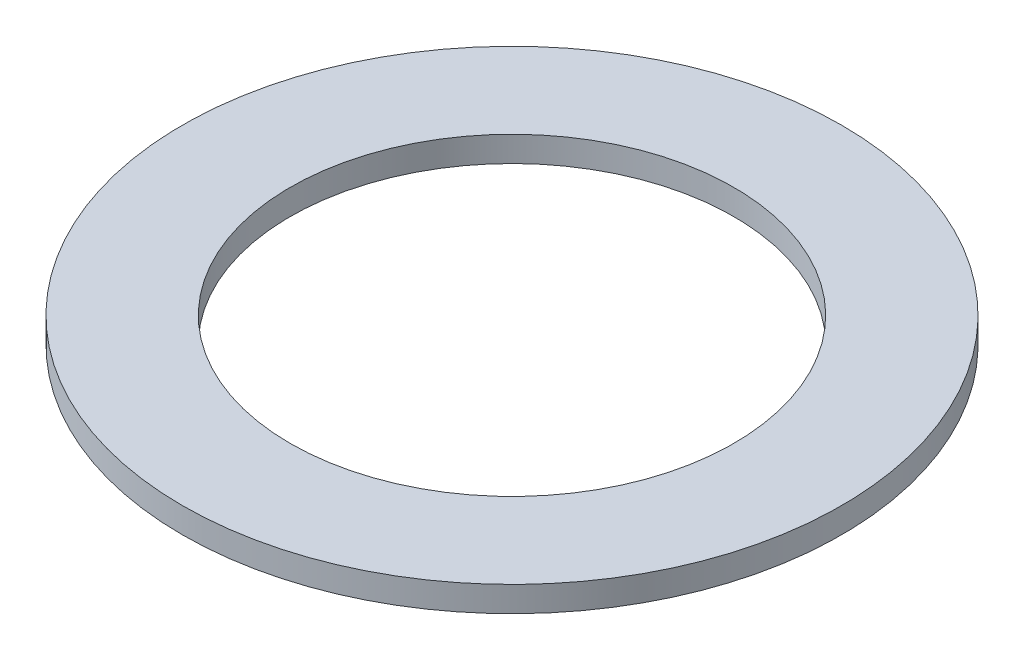
ISO-10303-21;
HEADER;
FILE_DESCRIPTION(('STEP AP214'),'2;1');
FILE_NAME('part.step','',(''),(''),'','','');
FILE_SCHEMA(('AUTOMOTIVE_DESIGN { 1 0 10303 214 1 1 1 1 }'));
ENDSEC;
DATA;
#1=APPLICATION_CONTEXT('core data for automotive mechanical design processes');
#2=APPLICATION_PROTOCOL_DEFINITION('international standard','automotive_design',2000,#1);
#3=PRODUCT_CONTEXT('',#1,'mechanical');
#4=PRODUCT('Part','Part','',(#3));
#5=PRODUCT_RELATED_PRODUCT_CATEGORY('part','',(#4));
#6=PRODUCT_DEFINITION_FORMATION('','',#4);
#7=PRODUCT_DEFINITION_CONTEXT('part definition',#1,'design');
#8=PRODUCT_DEFINITION('design','',#6,#7);
#9=PRODUCT_DEFINITION_SHAPE('','',#8);
#10=(LENGTH_UNIT() NAMED_UNIT(*) SI_UNIT(.MILLI.,.METRE.));
#11=(NAMED_UNIT(*) PLANE_ANGLE_UNIT() SI_UNIT($,.RADIAN.));
#12=(NAMED_UNIT(*) SI_UNIT($,.STERADIAN.) SOLID_ANGLE_UNIT());
#13=UNCERTAINTY_MEASURE_WITH_UNIT(LENGTH_MEASURE(1.E-05),#10,'distance_accuracy_value','');
#14=(GEOMETRIC_REPRESENTATION_CONTEXT(3) GLOBAL_UNCERTAINTY_ASSIGNED_CONTEXT((#13)) GLOBAL_UNIT_ASSIGNED_CONTEXT((#10,
#11,#12)) REPRESENTATION_CONTEXT('',''));
#15=CARTESIAN_POINT('',(0.,0.,0.));
#16=DIRECTION('',(0.,0.,1.));
#17=DIRECTION('',(1.,0.,0.));
#18=AXIS2_PLACEMENT_3D('',#15,#16,#17);
#19=CARTESIAN_POINT('',(0.,2.,0.));
#20=DIRECTION('',(0.,1.,0.));
#21=DIRECTION('',(0.,0.,1.));
#22=AXIS2_PLACEMENT_3D('',#19,#20,#21);
#23=PLANE('',#22);
#24=CARTESIAN_POINT('',(0.,2.,0.));
#25=DIRECTION('',(0.,1.,0.));
#26=DIRECTION('',(0.,0.,1.));
#27=AXIS2_PLACEMENT_3D('',#24,#25,#26);
#28=CIRCLE('',#27,26.);
#29=CARTESIAN_POINT('',(0.,2.,26.));
#30=VERTEX_POINT('',#29);
#31=EDGE_CURVE('E10',#30,#30,#28,.T.);
#32=ORIENTED_EDGE('',*,*,#31,.T.);
#33=EDGE_LOOP('',(#32));
#34=FACE_BOUND('',#33,.T.);
#35=CARTESIAN_POINT('',(0.,2.,0.));
#36=DIRECTION('',(0.,1.,0.));
#37=DIRECTION('',(0.,0.,1.));
#38=AXIS2_PLACEMENT_3D('',#35,#36,#37);
#39=CIRCLE('',#38,17.5);
#40=CARTESIAN_POINT('',(0.,2.,17.5));
#41=VERTEX_POINT('',#40);
#42=EDGE_CURVE('E50',#41,#41,#39,.T.);
#43=ORIENTED_EDGE('',*,*,#42,.F.);
#44=EDGE_LOOP('',(#43));
#45=FACE_BOUND('',#44,.T.);
#46=ADVANCED_FACE('F37',(#34,#45),#23,.T.);
#47=CARTESIAN_POINT('',(0.,0.,0.));
#48=DIRECTION('',(0.,1.,0.));
#49=DIRECTION('',(0.,0.,1.));
#50=AXIS2_PLACEMENT_3D('',#47,#48,#49);
#51=PLANE('',#50);
#52=CARTESIAN_POINT('',(0.,0.,0.));
#53=DIRECTION('',(0.,1.,0.));
#54=DIRECTION('',(0.,0.,1.));
#55=AXIS2_PLACEMENT_3D('',#52,#53,#54);
#56=CIRCLE('',#55,26.);
#57=CARTESIAN_POINT('',(0.,0.,26.));
#58=VERTEX_POINT('',#57);
#59=EDGE_CURVE('E41',#58,#58,#56,.T.);
#60=ORIENTED_EDGE('',*,*,#59,.F.);
#61=EDGE_LOOP('',(#60));
#62=FACE_BOUND('',#61,.T.);
#63=CARTESIAN_POINT('',(0.,0.,0.));
#64=DIRECTION('',(0.,1.,0.));
#65=DIRECTION('',(0.,0.,1.));
#66=AXIS2_PLACEMENT_3D('',#63,#64,#65);
#67=CIRCLE('',#66,17.5);
#68=CARTESIAN_POINT('',(0.,0.,17.5));
#69=VERTEX_POINT('',#68);
#70=EDGE_CURVE('E52',#69,#69,#67,.T.);
#71=ORIENTED_EDGE('',*,*,#70,.T.);
#72=EDGE_LOOP('',(#71));
#73=FACE_BOUND('',#72,.T.);
#74=ADVANCED_FACE('F64',(#62,#73),#51,.F.);
#75=CARTESIAN_POINT('',(0.,2.,0.));
#76=DIRECTION('',(0.,-1.,0.));
#77=DIRECTION('',(0.,0.,-1.));
#78=AXIS2_PLACEMENT_3D('',#75,#76,#77);
#79=CYLINDRICAL_SURFACE('',#78,26.);
#80=ORIENTED_EDGE('',*,*,#31,.F.);
#81=EDGE_LOOP('',(#80));
#82=FACE_BOUND('',#81,.T.);
#83=ORIENTED_EDGE('',*,*,#59,.T.);
#84=EDGE_LOOP('',(#83));
#85=FACE_BOUND('',#84,.T.);
#86=ADVANCED_FACE('F39',(#82,#85),#79,.T.);
#87=CARTESIAN_POINT('',(0.,2.,0.));
#88=DIRECTION('',(0.,-1.,0.));
#89=DIRECTION('',(0.,0.,-1.));
#90=AXIS2_PLACEMENT_3D('',#87,#88,#89);
#91=CYLINDRICAL_SURFACE('',#90,17.5);
#92=ORIENTED_EDGE('',*,*,#42,.T.);
#93=EDGE_LOOP('',(#92));
#94=FACE_BOUND('',#93,.T.);
#95=ORIENTED_EDGE('',*,*,#70,.F.);
#96=EDGE_LOOP('',(#95));
#97=FACE_BOUND('',#96,.T.);
#98=ADVANCED_FACE('F60',(#94,#97),#91,.F.);
#99=CLOSED_SHELL('',(#46,#74,#86,#98));
#100=MANIFOLD_SOLID_BREP('B2',#99);
#101=ADVANCED_BREP_SHAPE_REPRESENTATION('',(#18,#100),#14);
#102=SHAPE_DEFINITION_REPRESENTATION(#9,#101);
ENDSEC;
END-ISO-10303-21;
